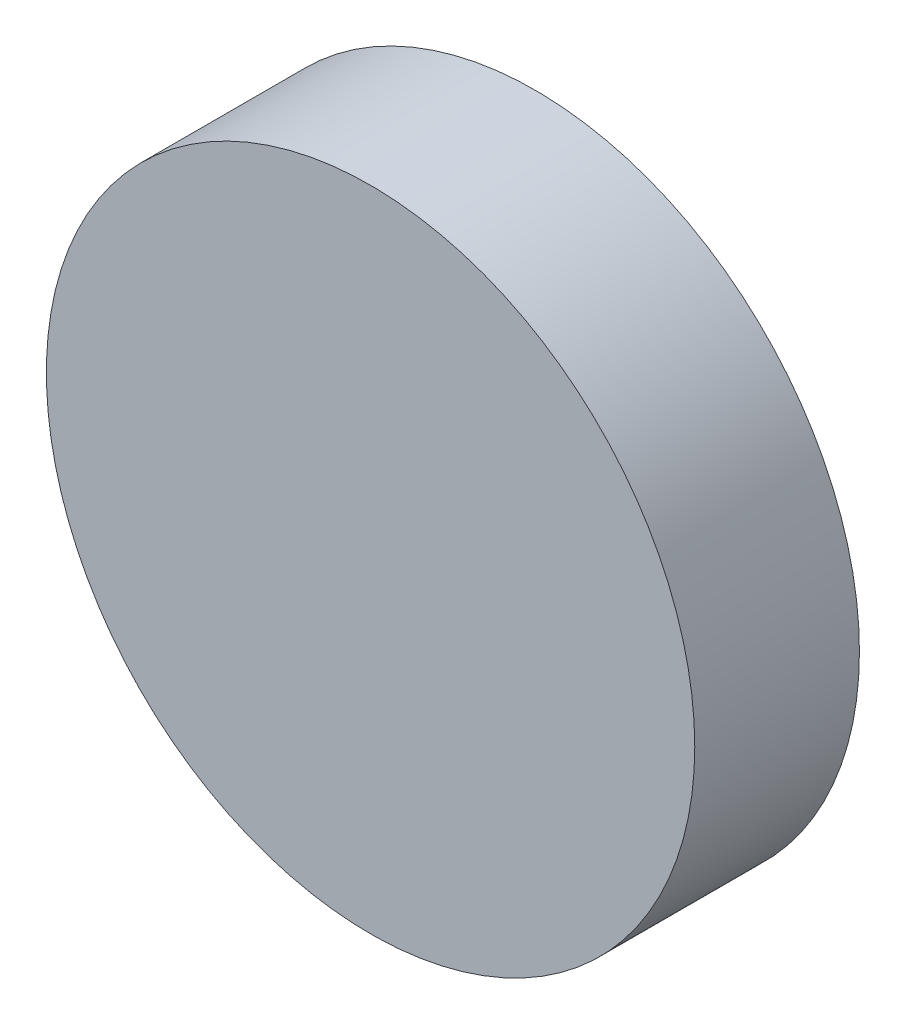
ISO-10303-21;
HEADER;
FILE_DESCRIPTION(('STEP AP214'),'2;1');
FILE_NAME('part.step','',(''),(''),'','','');
FILE_SCHEMA(('AUTOMOTIVE_DESIGN { 1 0 10303 214 1 1 1 1 }'));
ENDSEC;
DATA;
#1=APPLICATION_CONTEXT('core data for automotive mechanical design processes');
#2=APPLICATION_PROTOCOL_DEFINITION('international standard','automotive_design',2000,#1);
#3=PRODUCT_CONTEXT('',#1,'mechanical');
#4=PRODUCT('Part','Part','',(#3));
#5=PRODUCT_RELATED_PRODUCT_CATEGORY('part','',(#4));
#6=PRODUCT_DEFINITION_FORMATION('','',#4);
#7=PRODUCT_DEFINITION_CONTEXT('part definition',#1,'design');
#8=PRODUCT_DEFINITION('design','',#6,#7);
#9=PRODUCT_DEFINITION_SHAPE('','',#8);
#10=(LENGTH_UNIT() NAMED_UNIT(*) SI_UNIT(.MILLI.,.METRE.));
#11=(NAMED_UNIT(*) PLANE_ANGLE_UNIT() SI_UNIT($,.RADIAN.));
#12=(NAMED_UNIT(*) SI_UNIT($,.STERADIAN.) SOLID_ANGLE_UNIT());
#13=UNCERTAINTY_MEASURE_WITH_UNIT(LENGTH_MEASURE(1.E-05),#10,'distance_accuracy_value','');
#14=(GEOMETRIC_REPRESENTATION_CONTEXT(3) GLOBAL_UNCERTAINTY_ASSIGNED_CONTEXT((#13)) GLOBAL_UNIT_ASSIGNED_CONTEXT((#10,
#11,#12)) REPRESENTATION_CONTEXT('',''));
#15=CARTESIAN_POINT('',(0.,0.,0.));
#16=DIRECTION('',(0.,0.,1.));
#17=DIRECTION('',(1.,0.,0.));
#18=AXIS2_PLACEMENT_3D('',#15,#16,#17);
#19=CARTESIAN_POINT('',(0.,0.,8.));
#20=DIRECTION('',(0.,0.,-1.));
#21=DIRECTION('',(-1.,0.,0.));
#22=AXIS2_PLACEMENT_3D('',#19,#20,#21);
#23=CYLINDRICAL_SURFACE('',#22,15.75);
#24=CARTESIAN_POINT('',(0.,0.,8.));
#25=DIRECTION('',(0.,0.,1.));
#26=DIRECTION('',(1.,0.,0.));
#27=AXIS2_PLACEMENT_3D('',#24,#25,#26);
#28=CIRCLE('',#27,15.75);
#29=CARTESIAN_POINT('',(15.75,0.,8.));
#30=VERTEX_POINT('',#29);
#31=EDGE_CURVE('E10',#30,#30,#28,.T.);
#32=ORIENTED_EDGE('',*,*,#31,.F.);
#33=EDGE_LOOP('',(#32));
#34=FACE_BOUND('',#33,.T.);
#35=CARTESIAN_POINT('',(0.,0.,0.));
#36=DIRECTION('',(0.,0.,1.));
#37=DIRECTION('',(1.,0.,0.));
#38=AXIS2_PLACEMENT_3D('',#35,#36,#37);
#39=CIRCLE('',#38,15.75);
#40=CARTESIAN_POINT('',(15.75,0.,0.));
#41=VERTEX_POINT('',#40);
#42=EDGE_CURVE('E38',#41,#41,#39,.T.);
#43=ORIENTED_EDGE('',*,*,#42,.T.);
#44=EDGE_LOOP('',(#43));
#45=FACE_BOUND('',#44,.T.);
#46=ADVANCED_FACE('F35',(#34,#45),#23,.T.);
#47=CARTESIAN_POINT('',(0.,0.,8.));
#48=DIRECTION('',(0.,0.,1.));
#49=DIRECTION('',(1.,0.,0.));
#50=AXIS2_PLACEMENT_3D('',#47,#48,#49);
#51=PLANE('',#50);
#52=ORIENTED_EDGE('',*,*,#31,.T.);
#53=EDGE_LOOP('',(#52));
#54=FACE_BOUND('',#53,.T.);
#55=ADVANCED_FACE('F50',(#54),#51,.T.);
#56=CARTESIAN_POINT('',(0.,0.,0.));
#57=DIRECTION('',(0.,0.,1.));
#58=DIRECTION('',(1.,0.,0.));
#59=AXIS2_PLACEMENT_3D('',#56,#57,#58);
#60=PLANE('',#59);
#61=ORIENTED_EDGE('',*,*,#42,.F.);
#62=EDGE_LOOP('',(#61));
#63=FACE_BOUND('',#62,.T.);
#64=ADVANCED_FACE('F48',(#63),#60,.F.);
#65=CLOSED_SHELL('',(#46,#55,#64));
#66=MANIFOLD_SOLID_BREP('B2',#65);
#67=ADVANCED_BREP_SHAPE_REPRESENTATION('',(#18,#66),#14);
#68=SHAPE_DEFINITION_REPRESENTATION(#9,#67);
ENDSEC;
END-ISO-10303-21;
